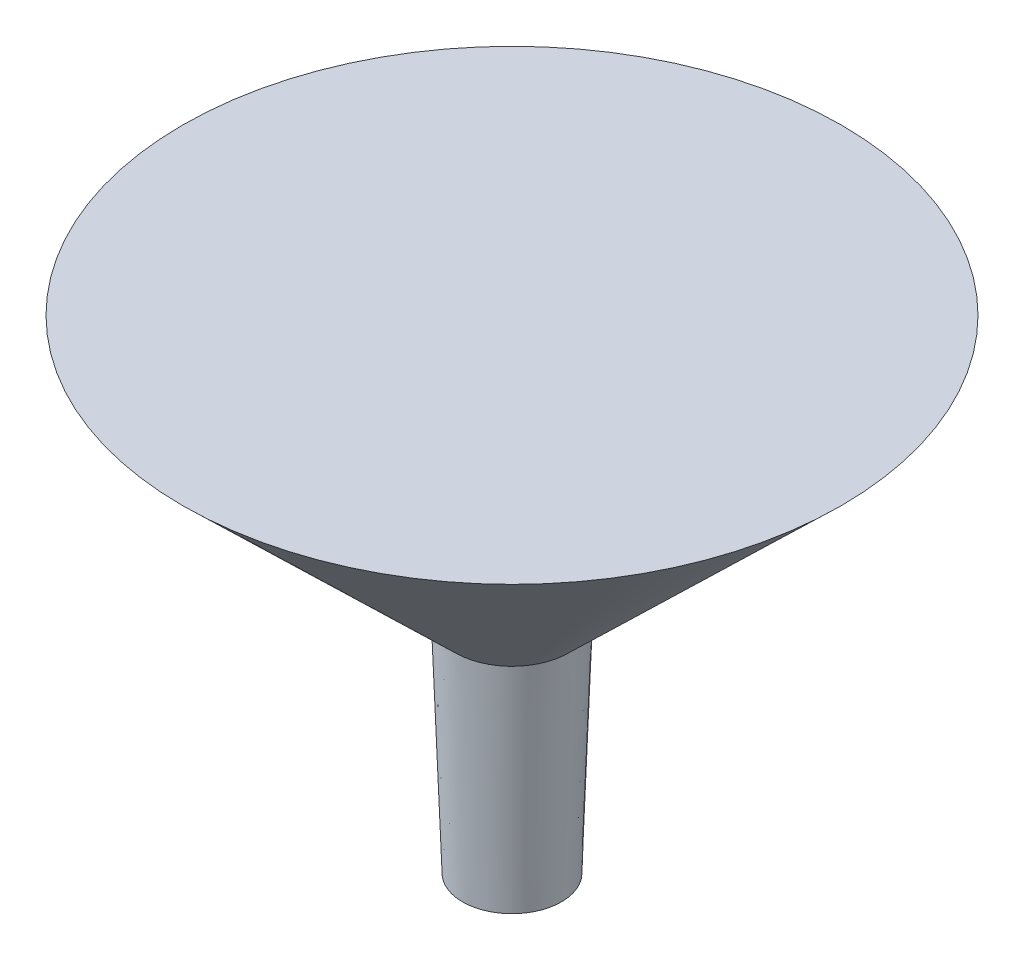
ISO-10303-21;
HEADER;
FILE_DESCRIPTION(('STEP AP214'),'2;1');
FILE_NAME('part.step','',(''),(''),'','','');
FILE_SCHEMA(('AUTOMOTIVE_DESIGN { 1 0 10303 214 1 1 1 1 }'));
ENDSEC;
DATA;
#1=APPLICATION_CONTEXT('core data for automotive mechanical design processes');
#2=APPLICATION_PROTOCOL_DEFINITION('international standard','automotive_design',2000,#1);
#3=PRODUCT_CONTEXT('',#1,'mechanical');
#4=PRODUCT('Part','Part','',(#3));
#5=PRODUCT_RELATED_PRODUCT_CATEGORY('part','',(#4));
#6=PRODUCT_DEFINITION_FORMATION('','',#4);
#7=PRODUCT_DEFINITION_CONTEXT('part definition',#1,'design');
#8=PRODUCT_DEFINITION('design','',#6,#7);
#9=PRODUCT_DEFINITION_SHAPE('','',#8);
#10=(LENGTH_UNIT() NAMED_UNIT(*) SI_UNIT(.MILLI.,.METRE.));
#11=(NAMED_UNIT(*) PLANE_ANGLE_UNIT() SI_UNIT($,.RADIAN.));
#12=(NAMED_UNIT(*) SI_UNIT($,.STERADIAN.) SOLID_ANGLE_UNIT());
#13=UNCERTAINTY_MEASURE_WITH_UNIT(LENGTH_MEASURE(1.E-05),#10,'distance_accuracy_value','');
#14=(GEOMETRIC_REPRESENTATION_CONTEXT(3) GLOBAL_UNCERTAINTY_ASSIGNED_CONTEXT((#13)) GLOBAL_UNIT_ASSIGNED_CONTEXT((#10,
#11,#12)) REPRESENTATION_CONTEXT('',''));
#15=CARTESIAN_POINT('',(0.,0.,0.));
#16=DIRECTION('',(0.,0.,1.));
#17=DIRECTION('',(1.,0.,0.));
#18=AXIS2_PLACEMENT_3D('',#15,#16,#17);
#19=CARTESIAN_POINT('',(0.,13.97,-19.05));
#20=DIRECTION('',(0.,-1.,0.));
#21=DIRECTION('',(0.,0.,-1.));
#22=AXIS2_PLACEMENT_3D('',#19,#20,#21);
#23=PLANE('',#22);
#24=CARTESIAN_POINT('',(0.,13.97,0.));
#25=DIRECTION('',(0.,1.,0.));
#26=DIRECTION('',(0.,0.,1.));
#27=AXIS2_PLACEMENT_3D('',#24,#25,#26);
#28=CIRCLE('',#27,19.05);
#29=CARTESIAN_POINT('',(0.,13.97,19.05));
#30=VERTEX_POINT('',#29);
#31=EDGE_CURVE('E43',#30,#30,#28,.T.);
#32=ORIENTED_EDGE('',*,*,#31,.T.);
#33=EDGE_LOOP('',(#32));
#34=FACE_BOUND('',#33,.T.);
#35=ADVANCED_FACE('F33',(#34),#23,.F.);
#36=CARTESIAN_POINT('',(0.,-13.97,0.));
#37=DIRECTION('',(0.,1.,0.));
#38=DIRECTION('',(0.,0.,1.));
#39=AXIS2_PLACEMENT_3D('',#36,#37,#38);
#40=PLANE('',#39);
#41=CARTESIAN_POINT('',(0.,-13.97,0.));
#42=DIRECTION('',(0.,1.,0.));
#43=DIRECTION('',(0.,0.,1.));
#44=AXIS2_PLACEMENT_3D('',#41,#42,#43);
#45=CIRCLE('',#44,2.8585062274549);
#46=CARTESIAN_POINT('',(0.,-13.97,2.8585062274549));
#47=VERTEX_POINT('',#46);
#48=EDGE_CURVE('E10',#47,#47,#45,.T.);
#49=ORIENTED_EDGE('',*,*,#48,.F.);
#50=EDGE_LOOP('',(#49));
#51=FACE_BOUND('',#50,.T.);
#52=ADVANCED_FACE('F58',(#51),#40,.F.);
#53=CARTESIAN_POINT('',(0.,-13.97,0.));
#54=DIRECTION('',(0.,1.,0.));
#55=DIRECTION('',(0.,0.,1.));
#56=AXIS2_PLACEMENT_3D('',#53,#54,#55);
#57=CONICAL_SURFACE('',#56,2.8585062274549,0.0349065850398787);
#58=CARTESIAN_POINT('',(0.,-1.27,0.));
#59=DIRECTION('',(0.,1.,0.));
#60=DIRECTION('',(0.,0.,1.));
#61=AXIS2_PLACEMENT_3D('',#58,#59,#60);
#62=CIRCLE('',#61,3.302);
#63=CARTESIAN_POINT('',(0.,-1.27,3.302));
#64=VERTEX_POINT('',#63);
#65=EDGE_CURVE('E39',#64,#64,#62,.T.);
#66=ORIENTED_EDGE('',*,*,#65,.F.);
#67=EDGE_LOOP('',(#66));
#68=FACE_BOUND('',#67,.T.);
#69=ORIENTED_EDGE('',*,*,#48,.T.);
#70=EDGE_LOOP('',(#69));
#71=FACE_BOUND('',#70,.T.);
#72=ADVANCED_FACE('F53',(#68,#71),#57,.T.);
#73=CARTESIAN_POINT('',(0.,-1.27,0.));
#74=DIRECTION('',(0.,1.,0.));
#75=DIRECTION('',(0.,0.,1.));
#76=AXIS2_PLACEMENT_3D('',#73,#74,#75);
#77=CONICAL_SURFACE('',#76,3.302,0.801790137705454);
#78=ORIENTED_EDGE('',*,*,#31,.F.);
#79=EDGE_LOOP('',(#78));
#80=FACE_BOUND('',#79,.T.);
#81=ORIENTED_EDGE('',*,*,#65,.T.);
#82=EDGE_LOOP('',(#81));
#83=FACE_BOUND('',#82,.T.);
#84=ADVANCED_FACE('F51',(#80,#83),#77,.T.);
#85=CLOSED_SHELL('',(#35,#52,#72,#84));
#86=MANIFOLD_SOLID_BREP('B2',#85);
#87=ADVANCED_BREP_SHAPE_REPRESENTATION('',(#18,#86),#14);
#88=SHAPE_DEFINITION_REPRESENTATION(#9,#87);
ENDSEC;
END-ISO-10303-21;
